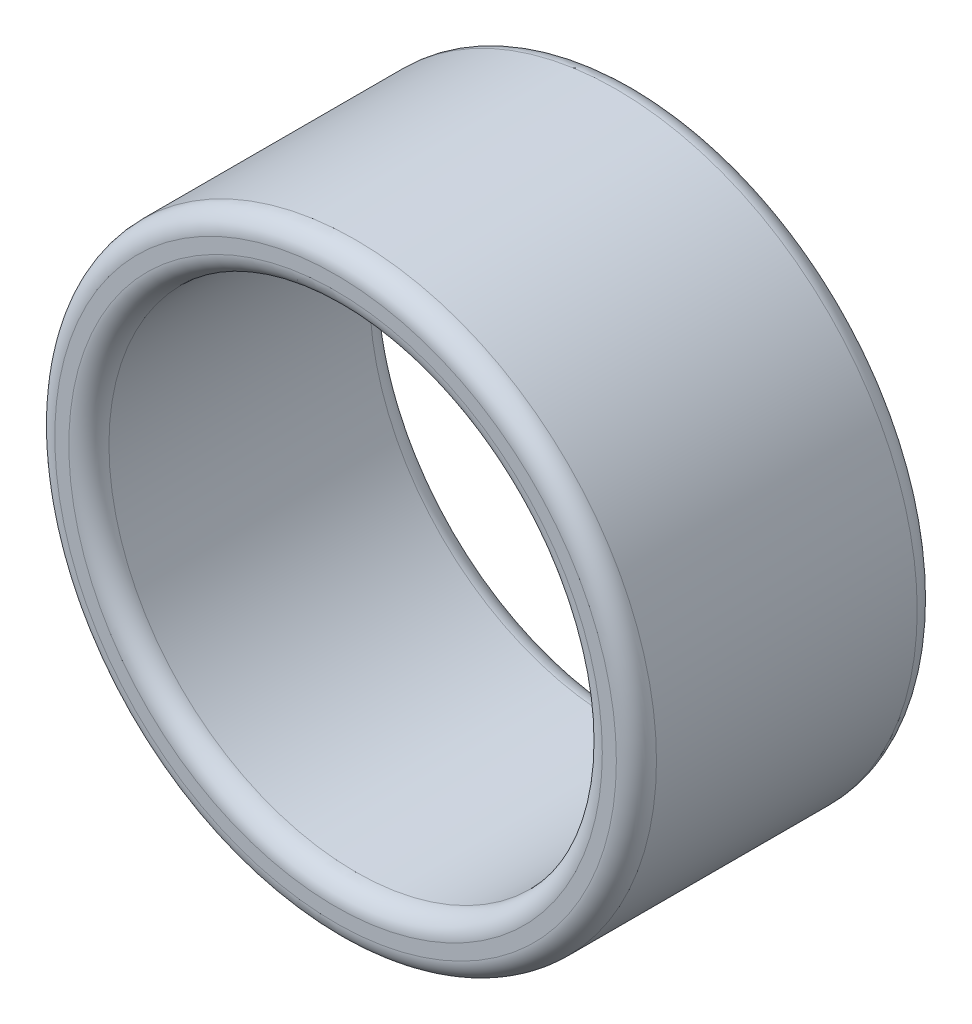
ISO-10303-21;
HEADER;
FILE_DESCRIPTION(('STEP AP214'),'2;1');
FILE_NAME('part.step','',(''),(''),'','','');
FILE_SCHEMA(('AUTOMOTIVE_DESIGN { 1 0 10303 214 1 1 1 1 }'));
ENDSEC;
DATA;
#1=APPLICATION_CONTEXT('core data for automotive mechanical design processes');
#2=APPLICATION_PROTOCOL_DEFINITION('international standard','automotive_design',2000,#1);
#3=PRODUCT_CONTEXT('',#1,'mechanical');
#4=PRODUCT('Part','Part','',(#3));
#5=PRODUCT_RELATED_PRODUCT_CATEGORY('part','',(#4));
#6=PRODUCT_DEFINITION_FORMATION('','',#4);
#7=PRODUCT_DEFINITION_CONTEXT('part definition',#1,'design');
#8=PRODUCT_DEFINITION('design','',#6,#7);
#9=PRODUCT_DEFINITION_SHAPE('','',#8);
#10=(LENGTH_UNIT() NAMED_UNIT(*) SI_UNIT(.MILLI.,.METRE.));
#11=(NAMED_UNIT(*) PLANE_ANGLE_UNIT() SI_UNIT($,.RADIAN.));
#12=(NAMED_UNIT(*) SI_UNIT($,.STERADIAN.) SOLID_ANGLE_UNIT());
#13=UNCERTAINTY_MEASURE_WITH_UNIT(LENGTH_MEASURE(1.E-05),#10,'distance_accuracy_value','');
#14=(GEOMETRIC_REPRESENTATION_CONTEXT(3) GLOBAL_UNCERTAINTY_ASSIGNED_CONTEXT((#13)) GLOBAL_UNIT_ASSIGNED_CONTEXT((#10,
#11,#12)) REPRESENTATION_CONTEXT('',''));
#15=CARTESIAN_POINT('',(0.,0.,0.));
#16=DIRECTION('',(0.,0.,1.));
#17=DIRECTION('',(1.,0.,0.));
#18=AXIS2_PLACEMENT_3D('',#15,#16,#17);
#19=CARTESIAN_POINT('',(0.,0.,1.905));
#20=DIRECTION('',(0.,0.,1.));
#21=DIRECTION('',(1.,0.,0.));
#22=AXIS2_PLACEMENT_3D('',#19,#20,#21);
#23=PLANE('',#22);
#24=CARTESIAN_POINT('',(0.,0.,1.905));
#25=DIRECTION('',(0.,0.,1.));
#26=DIRECTION('',(1.,0.,0.));
#27=AXIS2_PLACEMENT_3D('',#24,#25,#26);
#28=CIRCLE('',#27,1.6891);
#29=CARTESIAN_POINT('',(1.6891,0.,1.905));
#30=VERTEX_POINT('',#29);
#31=EDGE_CURVE('E54',#30,#30,#28,.F.);
#32=ORIENTED_EDGE('',*,*,#31,.T.);
#33=EDGE_LOOP('',(#32));
#34=FACE_BOUND('',#33,.T.);
#35=CARTESIAN_POINT('',(0.,0.,1.905));
#36=DIRECTION('',(0.,0.,1.));
#37=DIRECTION('',(1.,0.,0.));
#38=AXIS2_PLACEMENT_3D('',#35,#36,#37);
#39=CIRCLE('',#38,1.778);
#40=CARTESIAN_POINT('',(1.778,0.,1.905));
#41=VERTEX_POINT('',#40);
#42=EDGE_CURVE('E57',#41,#41,#39,.T.);
#43=ORIENTED_EDGE('',*,*,#42,.T.);
#44=EDGE_LOOP('',(#43));
#45=FACE_BOUND('',#44,.T.);
#46=ADVANCED_FACE('F34',(#34,#45),#23,.T.);
#47=CARTESIAN_POINT('',(0.,0.,0.));
#48=DIRECTION('',(0.,0.,1.));
#49=DIRECTION('',(1.,0.,0.));
#50=AXIS2_PLACEMENT_3D('',#47,#48,#49);
#51=PLANE('',#50);
#52=CARTESIAN_POINT('',(0.,0.,0.));
#53=DIRECTION('',(0.,0.,1.));
#54=DIRECTION('',(1.,0.,0.));
#55=AXIS2_PLACEMENT_3D('',#52,#53,#54);
#56=CIRCLE('',#55,1.6891);
#57=CARTESIAN_POINT('',(1.6891,0.,0.));
#58=VERTEX_POINT('',#57);
#59=EDGE_CURVE('E10',#58,#58,#56,.T.);
#60=ORIENTED_EDGE('',*,*,#59,.T.);
#61=EDGE_LOOP('',(#60));
#62=FACE_BOUND('',#61,.T.);
#63=CARTESIAN_POINT('',(0.,0.,0.));
#64=DIRECTION('',(0.,0.,1.));
#65=DIRECTION('',(1.,0.,0.));
#66=AXIS2_PLACEMENT_3D('',#63,#64,#65);
#67=CIRCLE('',#66,1.778);
#68=CARTESIAN_POINT('',(1.778,0.,0.));
#69=VERTEX_POINT('',#68);
#70=EDGE_CURVE('E41',#69,#69,#67,.F.);
#71=ORIENTED_EDGE('',*,*,#70,.T.);
#72=EDGE_LOOP('',(#71));
#73=FACE_BOUND('',#72,.T.);
#74=ADVANCED_FACE('F82',(#62,#73),#51,.F.);
#75=CARTESIAN_POINT('',(0.,0.,1.905));
#76=DIRECTION('',(0.,0.,-1.));
#77=DIRECTION('',(-1.,0.,0.));
#78=AXIS2_PLACEMENT_3D('',#75,#76,#77);
#79=CYLINDRICAL_SURFACE('',#78,1.905);
#80=CARTESIAN_POINT('',(0.,0.,1.778));
#81=DIRECTION('',(0.,0.,1.));
#82=DIRECTION('',(1.,0.,0.));
#83=AXIS2_PLACEMENT_3D('',#80,#81,#82);
#84=CIRCLE('',#83,1.905);
#85=CARTESIAN_POINT('',(1.905,0.,1.778));
#86=VERTEX_POINT('',#85);
#87=EDGE_CURVE('E45',#86,#86,#84,.F.);
#88=ORIENTED_EDGE('',*,*,#87,.T.);
#89=EDGE_LOOP('',(#88));
#90=FACE_BOUND('',#89,.T.);
#91=CARTESIAN_POINT('',(0.,0.,0.127));
#92=DIRECTION('',(0.,0.,1.));
#93=DIRECTION('',(1.,0.,0.));
#94=AXIS2_PLACEMENT_3D('',#91,#92,#93);
#95=CIRCLE('',#94,1.905);
#96=CARTESIAN_POINT('',(1.905,0.,0.127));
#97=VERTEX_POINT('',#96);
#98=EDGE_CURVE('E49',#97,#97,#95,.T.);
#99=ORIENTED_EDGE('',*,*,#98,.T.);
#100=EDGE_LOOP('',(#99));
#101=FACE_BOUND('',#100,.T.);
#102=ADVANCED_FACE('F88',(#90,#101),#79,.T.);
#103=CARTESIAN_POINT('',(0.,0.,1.905));
#104=DIRECTION('',(0.,0.,-1.));
#105=DIRECTION('',(-1.,0.,0.));
#106=AXIS2_PLACEMENT_3D('',#103,#104,#105);
#107=CYLINDRICAL_SURFACE('',#106,1.5621);
#108=CARTESIAN_POINT('',(0.,0.,1.778));
#109=DIRECTION('',(0.,0.,1.));
#110=DIRECTION('',(1.,0.,0.));
#111=AXIS2_PLACEMENT_3D('',#108,#109,#110);
#112=CIRCLE('',#111,1.5621);
#113=CARTESIAN_POINT('',(1.5621,0.,1.778));
#114=VERTEX_POINT('',#113);
#115=EDGE_CURVE('E60',#114,#114,#112,.T.);
#116=ORIENTED_EDGE('',*,*,#115,.T.);
#117=EDGE_LOOP('',(#116));
#118=FACE_BOUND('',#117,.T.);
#119=CARTESIAN_POINT('',(0.,0.,0.127));
#120=DIRECTION('',(0.,0.,1.));
#121=DIRECTION('',(1.,0.,0.));
#122=AXIS2_PLACEMENT_3D('',#119,#120,#121);
#123=CIRCLE('',#122,1.5621);
#124=CARTESIAN_POINT('',(1.5621,0.,0.127));
#125=VERTEX_POINT('',#124);
#126=EDGE_CURVE('E63',#125,#125,#123,.F.);
#127=ORIENTED_EDGE('',*,*,#126,.T.);
#128=EDGE_LOOP('',(#127));
#129=FACE_BOUND('',#128,.T.);
#130=ADVANCED_FACE('F67',(#118,#129),#107,.F.);
#131=CARTESIAN_POINT('',(0.,0.,1.778));
#132=DIRECTION('',(0.,0.,1.));
#133=DIRECTION('',(1.,0.,0.));
#134=AXIS2_PLACEMENT_3D('',#131,#132,#133);
#135=TOROIDAL_SURFACE('',#134,1.6891,0.127);
#136=ORIENTED_EDGE('',*,*,#31,.F.);
#137=EDGE_LOOP('',(#136));
#138=FACE_BOUND('',#137,.T.);
#139=ORIENTED_EDGE('',*,*,#115,.F.);
#140=EDGE_LOOP('',(#139));
#141=FACE_BOUND('',#140,.T.);
#142=ADVANCED_FACE('F78',(#138,#141),#135,.T.);
#143=CARTESIAN_POINT('',(0.,0.,1.778));
#144=DIRECTION('',(0.,0.,1.));
#145=DIRECTION('',(1.,0.,0.));
#146=AXIS2_PLACEMENT_3D('',#143,#144,#145);
#147=TOROIDAL_SURFACE('',#146,1.778,0.127);
#148=ORIENTED_EDGE('',*,*,#87,.F.);
#149=EDGE_LOOP('',(#148));
#150=FACE_BOUND('',#149,.T.);
#151=ORIENTED_EDGE('',*,*,#42,.F.);
#152=EDGE_LOOP('',(#151));
#153=FACE_BOUND('',#152,.T.);
#154=ADVANCED_FACE('F72',(#150,#153),#147,.T.);
#155=CARTESIAN_POINT('',(0.,0.,0.127));
#156=DIRECTION('',(0.,0.,1.));
#157=DIRECTION('',(1.,0.,0.));
#158=AXIS2_PLACEMENT_3D('',#155,#156,#157);
#159=TOROIDAL_SURFACE('',#158,1.6891,0.127);
#160=ORIENTED_EDGE('',*,*,#126,.F.);
#161=EDGE_LOOP('',(#160));
#162=FACE_BOUND('',#161,.T.);
#163=ORIENTED_EDGE('',*,*,#59,.F.);
#164=EDGE_LOOP('',(#163));
#165=FACE_BOUND('',#164,.T.);
#166=ADVANCED_FACE('F69',(#162,#165),#159,.T.);
#167=CARTESIAN_POINT('',(0.,0.,0.127));
#168=DIRECTION('',(0.,0.,1.));
#169=DIRECTION('',(1.,0.,0.));
#170=AXIS2_PLACEMENT_3D('',#167,#168,#169);
#171=TOROIDAL_SURFACE('',#170,1.778,0.127);
#172=ORIENTED_EDGE('',*,*,#70,.F.);
#173=EDGE_LOOP('',(#172));
#174=FACE_BOUND('',#173,.T.);
#175=ORIENTED_EDGE('',*,*,#98,.F.);
#176=EDGE_LOOP('',(#175));
#177=FACE_BOUND('',#176,.T.);
#178=ADVANCED_FACE('F36',(#174,#177),#171,.T.);
#179=CLOSED_SHELL('',(#46,#74,#102,#130,#142,#154,#166,#178));
#180=MANIFOLD_SOLID_BREP('B2',#179);
#181=ADVANCED_BREP_SHAPE_REPRESENTATION('',(#18,#180),#14);
#182=SHAPE_DEFINITION_REPRESENTATION(#9,#181);
ENDSEC;
END-ISO-10303-21;
